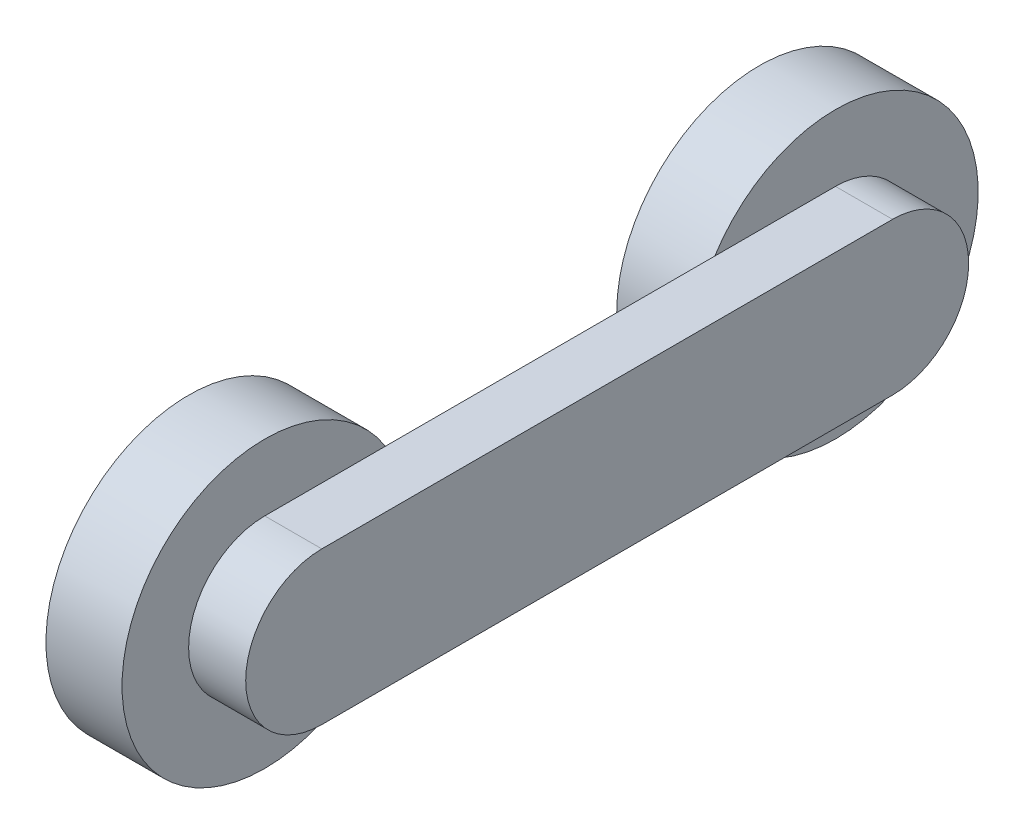
ISO-10303-21;
HEADER;
FILE_DESCRIPTION(('STEP AP214'),'2;1');
FILE_NAME('part.step','',(''),(''),'','','');
FILE_SCHEMA(('AUTOMOTIVE_DESIGN { 1 0 10303 214 1 1 1 1 }'));
ENDSEC;
DATA;
#1=APPLICATION_CONTEXT('core data for automotive mechanical design processes');
#2=APPLICATION_PROTOCOL_DEFINITION('international standard','automotive_design',2000,#1);
#3=PRODUCT_CONTEXT('',#1,'mechanical');
#4=PRODUCT('Part','Part','',(#3));
#5=PRODUCT_RELATED_PRODUCT_CATEGORY('part','',(#4));
#6=PRODUCT_DEFINITION_FORMATION('','',#4);
#7=PRODUCT_DEFINITION_CONTEXT('part definition',#1,'design');
#8=PRODUCT_DEFINITION('design','',#6,#7);
#9=PRODUCT_DEFINITION_SHAPE('','',#8);
#10=(LENGTH_UNIT() NAMED_UNIT(*) SI_UNIT(.MILLI.,.METRE.));
#11=(NAMED_UNIT(*) PLANE_ANGLE_UNIT() SI_UNIT($,.RADIAN.));
#12=(NAMED_UNIT(*) SI_UNIT($,.STERADIAN.) SOLID_ANGLE_UNIT());
#13=UNCERTAINTY_MEASURE_WITH_UNIT(LENGTH_MEASURE(1.E-05),#10,'distance_accuracy_value','');
#14=(GEOMETRIC_REPRESENTATION_CONTEXT(3) GLOBAL_UNCERTAINTY_ASSIGNED_CONTEXT((#13)) GLOBAL_UNIT_ASSIGNED_CONTEXT((#10,
#11,#12)) REPRESENTATION_CONTEXT('',''));
#15=CARTESIAN_POINT('',(0.,0.,0.));
#16=DIRECTION('',(0.,0.,1.));
#17=DIRECTION('',(1.,0.,0.));
#18=AXIS2_PLACEMENT_3D('',#15,#16,#17);
#19=CARTESIAN_POINT('',(40.,0.,0.));
#20=DIRECTION('',(-1.,0.,0.));
#21=DIRECTION('',(0.,0.,1.));
#22=AXIS2_PLACEMENT_3D('',#19,#20,#21);
#23=CYLINDRICAL_SURFACE('',#22,75.);
#24=CARTESIAN_POINT('',(40.,0.,0.));
#25=DIRECTION('',(1.,0.,0.));
#26=DIRECTION('',(0.,0.,-1.));
#27=AXIS2_PLACEMENT_3D('',#24,#25,#26);
#28=CIRCLE('',#27,75.);
#29=CARTESIAN_POINT('',(40.,40.,-63.4428877022476));
#30=VERTEX_POINT('',#29);
#31=CARTESIAN_POINT('',(40.,-40.,-63.4428877022476));
#32=VERTEX_POINT('',#31);
#33=EDGE_CURVE('E52',#30,#32,#28,.T.);
#34=ORIENTED_EDGE('',*,*,#33,.F.);
#35=EDGE_CURVE('E153',#32,#30,#28,.T.);
#36=ORIENTED_EDGE('',*,*,#35,.F.);
#37=EDGE_LOOP('',(#34,#36));
#38=FACE_BOUND('',#37,.T.);
#39=CARTESIAN_POINT('',(0.,0.,0.));
#40=DIRECTION('',(1.,0.,0.));
#41=DIRECTION('',(0.,0.,-1.));
#42=AXIS2_PLACEMENT_3D('',#39,#40,#41);
#43=CIRCLE('',#42,75.);
#44=CARTESIAN_POINT('',(0.,0.,-75.));
#45=VERTEX_POINT('',#44);
#46=EDGE_CURVE('E46',#45,#45,#43,.T.);
#47=ORIENTED_EDGE('',*,*,#46,.T.);
#48=EDGE_LOOP('',(#47));
#49=FACE_BOUND('',#48,.T.);
#50=ADVANCED_FACE('F43',(#38,#49),#23,.T.);
#51=CARTESIAN_POINT('',(40.,0.,0.));
#52=DIRECTION('',(1.,0.,0.));
#53=DIRECTION('',(0.,0.,-1.));
#54=AXIS2_PLACEMENT_3D('',#51,#52,#53);
#55=PLANE('',#54);
#56=DIRECTION('',(0.,0.,1.));
#57=VECTOR('',#56,1.);
#58=CARTESIAN_POINT('',(40.,40.,0.));
#59=LINE('',#58,#57);
#60=CARTESIAN_POINT('',(40.,40.,0.));
#61=VERTEX_POINT('',#60);
#62=EDGE_CURVE('E11',#30,#61,#59,.T.);
#63=ORIENTED_EDGE('',*,*,#62,.F.);
#64=ORIENTED_EDGE('',*,*,#33,.T.);
#65=DIRECTION('',(0.,0.,-1.));
#66=VECTOR('',#65,1.);
#67=CARTESIAN_POINT('',(40.,-40.,0.));
#68=LINE('',#67,#66);
#69=CARTESIAN_POINT('',(40.,-40.,0.));
#70=VERTEX_POINT('',#69);
#71=EDGE_CURVE('E126',#70,#32,#68,.T.);
#72=ORIENTED_EDGE('',*,*,#71,.F.);
#73=CARTESIAN_POINT('',(40.,0.,0.));
#74=DIRECTION('',(1.,0.,0.));
#75=DIRECTION('',(0.,0.,-1.));
#76=AXIS2_PLACEMENT_3D('',#73,#74,#75);
#77=CIRCLE('',#76,40.);
#78=EDGE_CURVE('E70',#61,#70,#77,.T.);
#79=ORIENTED_EDGE('',*,*,#78,.F.);
#80=EDGE_LOOP('',(#63,#64,#72,#79));
#81=FACE_BOUND('',#80,.T.);
#82=ADVANCED_FACE('F164',(#81),#55,.T.);
#83=CARTESIAN_POINT('',(0.,0.,0.));
#84=DIRECTION('',(1.,0.,0.));
#85=DIRECTION('',(0.,0.,-1.));
#86=AXIS2_PLACEMENT_3D('',#83,#84,#85);
#87=PLANE('',#86);
#88=ORIENTED_EDGE('',*,*,#46,.F.);
#89=EDGE_LOOP('',(#88));
#90=FACE_BOUND('',#89,.T.);
#91=ADVANCED_FACE('F162',(#90),#87,.F.);
#92=CARTESIAN_POINT('',(40.,0.,0.));
#93=DIRECTION('',(1.,0.,0.));
#94=DIRECTION('',(0.,0.,-1.));
#95=AXIS2_PLACEMENT_3D('',#92,#93,#94);
#96=PLANE('',#95);
#97=CARTESIAN_POINT('',(40.,0.,-300.));
#98=DIRECTION('',(-1.,0.,0.));
#99=DIRECTION('',(0.,0.,1.));
#100=AXIS2_PLACEMENT_3D('',#97,#98,#99);
#101=CIRCLE('',#100,75.);
#102=CARTESIAN_POINT('',(40.,-40.,-236.557112297752));
#103=VERTEX_POINT('',#102);
#104=CARTESIAN_POINT('',(40.,40.,-236.557112297752));
#105=VERTEX_POINT('',#104);
#106=EDGE_CURVE('E112',#103,#105,#101,.T.);
#107=ORIENTED_EDGE('',*,*,#106,.F.);
#108=EDGE_CURVE('E120',#32,#103,#68,.T.);
#109=ORIENTED_EDGE('',*,*,#108,.F.);
#110=ORIENTED_EDGE('',*,*,#35,.T.);
#111=EDGE_CURVE('E55',#105,#30,#59,.T.);
#112=ORIENTED_EDGE('',*,*,#111,.F.);
#113=EDGE_LOOP('',(#107,#109,#110,#112));
#114=FACE_BOUND('',#113,.T.);
#115=ADVANCED_FACE('F118',(#114),#96,.F.);
#116=CARTESIAN_POINT('',(70.,0.,0.));
#117=DIRECTION('',(-1.,0.,0.));
#118=DIRECTION('',(0.,0.,1.));
#119=AXIS2_PLACEMENT_3D('',#116,#117,#118);
#120=CYLINDRICAL_SURFACE('',#119,40.);
#121=ORIENTED_EDGE('',*,*,#78,.T.);
#122=DIRECTION('',(-1.,0.,0.));
#123=VECTOR('',#122,1.);
#124=CARTESIAN_POINT('',(70.,-40.,0.));
#125=LINE('',#124,#123);
#126=CARTESIAN_POINT('',(70.,-40.,0.));
#127=VERTEX_POINT('',#126);
#128=EDGE_CURVE('E150',#127,#70,#125,.T.);
#129=ORIENTED_EDGE('',*,*,#128,.F.);
#130=CARTESIAN_POINT('',(70.,0.,0.));
#131=DIRECTION('',(1.,0.,0.));
#132=DIRECTION('',(0.,0.,-1.));
#133=AXIS2_PLACEMENT_3D('',#130,#131,#132);
#134=CIRCLE('',#133,40.);
#135=CARTESIAN_POINT('',(70.,40.,0.));
#136=VERTEX_POINT('',#135);
#137=EDGE_CURVE('E137',#136,#127,#134,.T.);
#138=ORIENTED_EDGE('',*,*,#137,.F.);
#139=DIRECTION('',(-1.,0.,0.));
#140=VECTOR('',#139,1.);
#141=CARTESIAN_POINT('',(70.,40.,0.));
#142=LINE('',#141,#140);
#143=EDGE_CURVE('E138',#136,#61,#142,.T.);
#144=ORIENTED_EDGE('',*,*,#143,.T.);
#145=EDGE_LOOP('',(#121,#129,#138,#144));
#146=FACE_BOUND('',#145,.T.);
#147=ADVANCED_FACE('F169',(#146),#120,.T.);
#148=CARTESIAN_POINT('',(70.,-40.,0.));
#149=DIRECTION('',(0.,1.,0.));
#150=DIRECTION('',(0.,0.,1.));
#151=AXIS2_PLACEMENT_3D('',#148,#149,#150);
#152=PLANE('',#151);
#153=ORIENTED_EDGE('',*,*,#71,.T.);
#154=ORIENTED_EDGE('',*,*,#108,.T.);
#155=DIRECTION('',(0.,0.,1.));
#156=VECTOR('',#155,1.);
#157=CARTESIAN_POINT('',(40.,-40.,0.));
#158=LINE('',#157,#156);
#159=CARTESIAN_POINT('',(40.,-40.,-300.));
#160=VERTEX_POINT('',#159);
#161=EDGE_CURVE('E98',#160,#103,#158,.T.);
#162=ORIENTED_EDGE('',*,*,#161,.F.);
#163=DIRECTION('',(-1.,0.,0.));
#164=VECTOR('',#163,1.);
#165=CARTESIAN_POINT('',(70.,-40.,-300.));
#166=LINE('',#165,#164);
#167=CARTESIAN_POINT('',(70.,-40.,-300.));
#168=VERTEX_POINT('',#167);
#169=EDGE_CURVE('E147',#168,#160,#166,.T.);
#170=ORIENTED_EDGE('',*,*,#169,.F.);
#171=DIRECTION('',(0.,0.,-1.));
#172=VECTOR('',#171,1.);
#173=CARTESIAN_POINT('',(70.,-40.,0.));
#174=LINE('',#173,#172);
#175=EDGE_CURVE('E302',#127,#168,#174,.T.);
#176=ORIENTED_EDGE('',*,*,#175,.F.);
#177=ORIENTED_EDGE('',*,*,#128,.T.);
#178=EDGE_LOOP('',(#153,#154,#162,#170,#176,#177));
#179=FACE_BOUND('',#178,.T.);
#180=ADVANCED_FACE('F124',(#179),#152,.F.);
#181=CARTESIAN_POINT('',(70.,0.,-300.));
#182=DIRECTION('',(-1.,0.,0.));
#183=DIRECTION('',(0.,0.,1.));
#184=AXIS2_PLACEMENT_3D('',#181,#182,#183);
#185=CYLINDRICAL_SURFACE('',#184,40.);
#186=CARTESIAN_POINT('',(40.,0.,-300.));
#187=DIRECTION('',(1.,0.,0.));
#188=DIRECTION('',(0.,0.,-1.));
#189=AXIS2_PLACEMENT_3D('',#186,#187,#188);
#190=CIRCLE('',#189,40.);
#191=CARTESIAN_POINT('',(40.,40.,-300.));
#192=VERTEX_POINT('',#191);
#193=EDGE_CURVE('E101',#160,#192,#190,.T.);
#194=ORIENTED_EDGE('',*,*,#193,.T.);
#195=DIRECTION('',(-1.,0.,0.));
#196=VECTOR('',#195,1.);
#197=CARTESIAN_POINT('',(70.,40.,-300.));
#198=LINE('',#197,#196);
#199=CARTESIAN_POINT('',(70.,40.,-300.));
#200=VERTEX_POINT('',#199);
#201=EDGE_CURVE('E142',#200,#192,#198,.T.);
#202=ORIENTED_EDGE('',*,*,#201,.F.);
#203=CARTESIAN_POINT('',(70.,0.,-300.));
#204=DIRECTION('',(1.,0.,0.));
#205=DIRECTION('',(0.,0.,-1.));
#206=AXIS2_PLACEMENT_3D('',#203,#204,#205);
#207=CIRCLE('',#206,40.);
#208=EDGE_CURVE('E305',#168,#200,#207,.T.);
#209=ORIENTED_EDGE('',*,*,#208,.F.);
#210=ORIENTED_EDGE('',*,*,#169,.T.);
#211=EDGE_LOOP('',(#194,#202,#209,#210));
#212=FACE_BOUND('',#211,.T.);
#213=ADVANCED_FACE('F224',(#212),#185,.T.);
#214=CARTESIAN_POINT('',(70.,40.,0.));
#215=DIRECTION('',(0.,-1.,0.));
#216=DIRECTION('',(0.,0.,-1.));
#217=AXIS2_PLACEMENT_3D('',#214,#215,#216);
#218=PLANE('',#217);
#219=EDGE_CURVE('E54',#192,#105,#59,.T.);
#220=ORIENTED_EDGE('',*,*,#219,.T.);
#221=ORIENTED_EDGE('',*,*,#111,.T.);
#222=ORIENTED_EDGE('',*,*,#62,.T.);
#223=ORIENTED_EDGE('',*,*,#143,.F.);
#224=DIRECTION('',(0.,0.,1.));
#225=VECTOR('',#224,1.);
#226=CARTESIAN_POINT('',(70.,40.,0.));
#227=LINE('',#226,#225);
#228=EDGE_CURVE('E143',#200,#136,#227,.T.);
#229=ORIENTED_EDGE('',*,*,#228,.F.);
#230=ORIENTED_EDGE('',*,*,#201,.T.);
#231=EDGE_LOOP('',(#220,#221,#222,#223,#229,#230));
#232=FACE_BOUND('',#231,.T.);
#233=ADVANCED_FACE('F205',(#232),#218,.F.);
#234=CARTESIAN_POINT('',(70.,0.,0.));
#235=DIRECTION('',(1.,0.,0.));
#236=DIRECTION('',(0.,0.,-1.));
#237=AXIS2_PLACEMENT_3D('',#234,#235,#236);
#238=PLANE('',#237);
#239=ORIENTED_EDGE('',*,*,#137,.T.);
#240=ORIENTED_EDGE('',*,*,#175,.T.);
#241=ORIENTED_EDGE('',*,*,#208,.T.);
#242=ORIENTED_EDGE('',*,*,#228,.T.);
#243=EDGE_LOOP('',(#239,#240,#241,#242));
#244=FACE_BOUND('',#243,.T.);
#245=ADVANCED_FACE('F200',(#244),#238,.T.);
#246=CARTESIAN_POINT('',(40.,0.,-300.));
#247=DIRECTION('',(-1.,0.,0.));
#248=DIRECTION('',(0.,0.,1.));
#249=AXIS2_PLACEMENT_3D('',#246,#247,#248);
#250=PLANE('',#249);
#251=ORIENTED_EDGE('',*,*,#193,.F.);
#252=ORIENTED_EDGE('',*,*,#161,.T.);
#253=EDGE_CURVE('E62',#105,#103,#101,.T.);
#254=ORIENTED_EDGE('',*,*,#253,.F.);
#255=ORIENTED_EDGE('',*,*,#219,.F.);
#256=EDGE_LOOP('',(#251,#252,#254,#255));
#257=FACE_BOUND('',#256,.T.);
#258=ADVANCED_FACE('F99',(#257),#250,.F.);
#259=CARTESIAN_POINT('',(0.,0.,-300.));
#260=DIRECTION('',(1.,0.,0.));
#261=DIRECTION('',(0.,0.,-1.));
#262=AXIS2_PLACEMENT_3D('',#259,#260,#261);
#263=CYLINDRICAL_SURFACE('',#262,75.);
#264=CARTESIAN_POINT('',(0.,0.,-300.));
#265=DIRECTION('',(-1.,0.,0.));
#266=DIRECTION('',(0.,0.,1.));
#267=AXIS2_PLACEMENT_3D('',#264,#265,#266);
#268=CIRCLE('',#267,75.);
#269=CARTESIAN_POINT('',(0.,0.,-225.));
#270=VERTEX_POINT('',#269);
#271=EDGE_CURVE('E107',#270,#270,#268,.T.);
#272=ORIENTED_EDGE('',*,*,#271,.F.);
#273=EDGE_LOOP('',(#272));
#274=FACE_BOUND('',#273,.T.);
#275=ORIENTED_EDGE('',*,*,#253,.T.);
#276=ORIENTED_EDGE('',*,*,#106,.T.);
#277=EDGE_LOOP('',(#275,#276));
#278=FACE_BOUND('',#277,.T.);
#279=ADVANCED_FACE('F111',(#274,#278),#263,.T.);
#280=CARTESIAN_POINT('',(0.,0.,-300.));
#281=DIRECTION('',(-1.,0.,0.));
#282=DIRECTION('',(0.,0.,1.));
#283=AXIS2_PLACEMENT_3D('',#280,#281,#282);
#284=PLANE('',#283);
#285=ORIENTED_EDGE('',*,*,#271,.T.);
#286=EDGE_LOOP('',(#285));
#287=FACE_BOUND('',#286,.T.);
#288=ADVANCED_FACE('F259',(#287),#284,.T.);
#289=CLOSED_SHELL('',(#50,#82,#91,#115,#147,#180,#213,#233,#245,#258,#279,#288));
#290=MANIFOLD_SOLID_BREP('B2',#289);
#291=ADVANCED_BREP_SHAPE_REPRESENTATION('',(#18,#290),#14);
#292=SHAPE_DEFINITION_REPRESENTATION(#9,#291);
ENDSEC;
END-ISO-10303-21;
